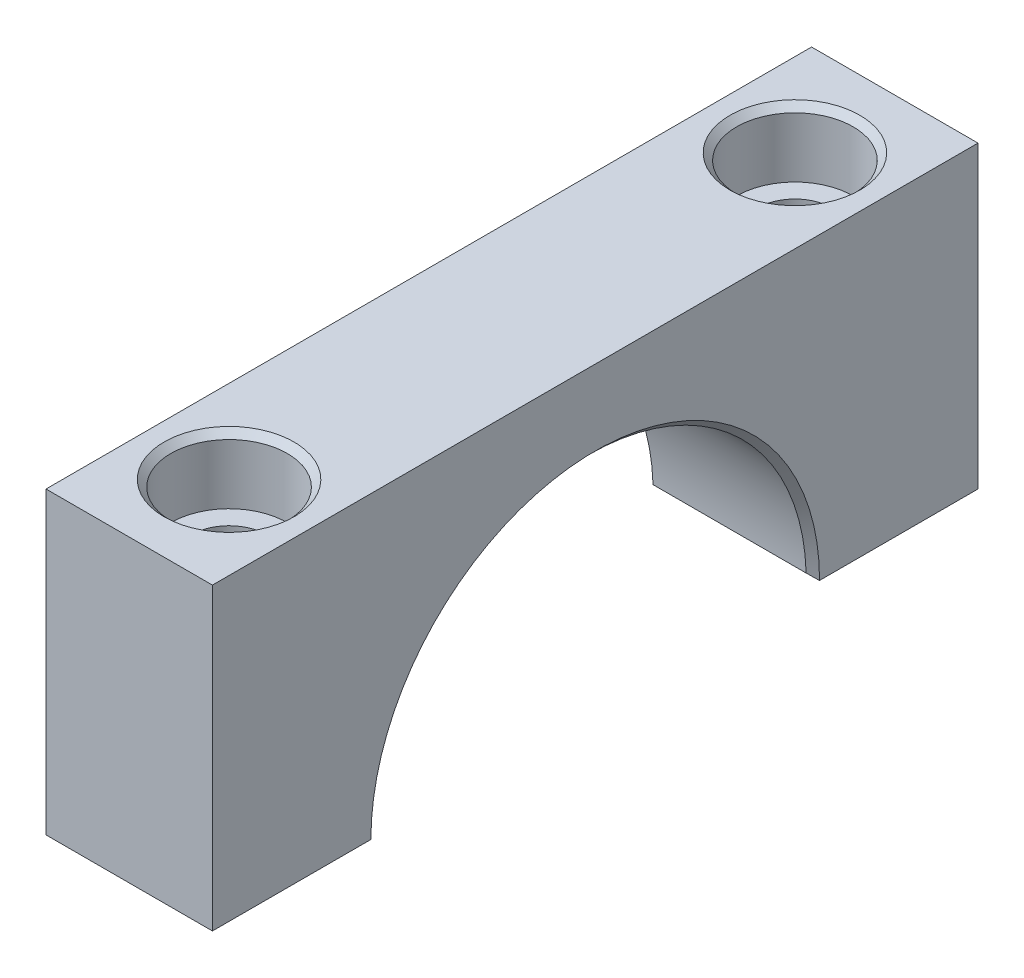
ISO-10303-21;
HEADER;
FILE_DESCRIPTION(('STEP AP214'),'2;1');
FILE_NAME('part.step','',(''),(''),'','','');
FILE_SCHEMA(('AUTOMOTIVE_DESIGN { 1 0 10303 214 1 1 1 1 }'));
ENDSEC;
DATA;
#1=APPLICATION_CONTEXT('core data for automotive mechanical design processes');
#2=APPLICATION_PROTOCOL_DEFINITION('international standard','automotive_design',2000,#1);
#3=PRODUCT_CONTEXT('',#1,'mechanical');
#4=PRODUCT('Part','Part','',(#3));
#5=PRODUCT_RELATED_PRODUCT_CATEGORY('part','',(#4));
#6=PRODUCT_DEFINITION_FORMATION('','',#4);
#7=PRODUCT_DEFINITION_CONTEXT('part definition',#1,'design');
#8=PRODUCT_DEFINITION('design','',#6,#7);
#9=PRODUCT_DEFINITION_SHAPE('','',#8);
#10=(LENGTH_UNIT() NAMED_UNIT(*) SI_UNIT(.MILLI.,.METRE.));
#11=(NAMED_UNIT(*) PLANE_ANGLE_UNIT() SI_UNIT($,.RADIAN.));
#12=(NAMED_UNIT(*) SI_UNIT($,.STERADIAN.) SOLID_ANGLE_UNIT());
#13=UNCERTAINTY_MEASURE_WITH_UNIT(LENGTH_MEASURE(1.E-05),#10,'distance_accuracy_value','');
#14=(GEOMETRIC_REPRESENTATION_CONTEXT(3) GLOBAL_UNCERTAINTY_ASSIGNED_CONTEXT((#13)) GLOBAL_UNIT_ASSIGNED_CONTEXT((#10,
#11,#12)) REPRESENTATION_CONTEXT('',''));
#15=CARTESIAN_POINT('',(0.,0.,0.));
#16=DIRECTION('',(0.,0.,1.));
#17=DIRECTION('',(1.,0.,0.));
#18=AXIS2_PLACEMENT_3D('',#15,#16,#17);
#19=CARTESIAN_POINT('',(15.875,0.,0.));
#20=DIRECTION('',(-1.,0.,0.));
#21=DIRECTION('',(0.,0.,1.));
#22=AXIS2_PLACEMENT_3D('',#19,#20,#21);
#23=CYLINDRICAL_SURFACE('',#22,20.7645);
#24=CARTESIAN_POINT('',(15.24,0.,0.));
#25=DIRECTION('',(1.,0.,0.));
#26=DIRECTION('',(0.,0.,-1.));
#27=AXIS2_PLACEMENT_3D('',#24,#25,#26);
#28=CIRCLE('',#27,20.7645);
#29=CARTESIAN_POINT('',(15.24,0.616157270029674,-20.7553561874662));
#30=VERTEX_POINT('',#29);
#31=CARTESIAN_POINT('',(15.24,0.616157270029674,20.7553561874662));
#32=VERTEX_POINT('',#31);
#33=EDGE_CURVE('E209',#30,#32,#28,.T.);
#34=ORIENTED_EDGE('',*,*,#33,.T.);
#35=DIRECTION('',(-1.,0.,0.));
#36=VECTOR('',#35,1.);
#37=CARTESIAN_POINT('',(15.875,0.616157270029674,20.7553561874662));
#38=LINE('',#37,#36);
#39=CARTESIAN_POINT('',(0.635,0.616157270029674,20.7553561874662));
#40=VERTEX_POINT('',#39);
#41=EDGE_CURVE('E211',#32,#40,#38,.T.);
#42=ORIENTED_EDGE('',*,*,#41,.T.);
#43=CARTESIAN_POINT('',(0.635,0.,0.));
#44=DIRECTION('',(1.,0.,0.));
#45=DIRECTION('',(0.,0.,-1.));
#46=AXIS2_PLACEMENT_3D('',#43,#44,#45);
#47=CIRCLE('',#46,20.7645);
#48=CARTESIAN_POINT('',(0.635,0.616157270029674,-20.7553561874662));
#49=VERTEX_POINT('',#48);
#50=EDGE_CURVE('E150',#40,#49,#47,.F.);
#51=ORIENTED_EDGE('',*,*,#50,.T.);
#52=DIRECTION('',(-1.,0.,0.));
#53=VECTOR('',#52,1.);
#54=CARTESIAN_POINT('',(15.875,0.616157270029674,-20.7553561874662));
#55=LINE('',#54,#53);
#56=EDGE_CURVE('E207',#49,#30,#55,.F.);
#57=ORIENTED_EDGE('',*,*,#56,.T.);
#58=EDGE_LOOP('',(#34,#42,#51,#57));
#59=FACE_BOUND('',#58,.T.);
#60=ADVANCED_FACE('F49',(#59),#23,.F.);
#61=CARTESIAN_POINT('',(15.875,0.,0.));
#62=DIRECTION('',(0.,1.,0.));
#63=DIRECTION('',(0.,0.,1.));
#64=AXIS2_PLACEMENT_3D('',#61,#62,#63);
#65=PLANE('',#64);
#66=CARTESIAN_POINT('',(7.9375,0.,-26.9875));
#67=DIRECTION('',(0.,1.,0.));
#68=DIRECTION('',(0.,0.,1.));
#69=AXIS2_PLACEMENT_3D('',#66,#67,#68);
#70=CIRCLE('',#69,3.57123999999999);
#71=CARTESIAN_POINT('',(7.9375,0.,-23.41626));
#72=VERTEX_POINT('',#71);
#73=EDGE_CURVE('E164',#72,#72,#70,.T.);
#74=ORIENTED_EDGE('',*,*,#73,.T.);
#75=EDGE_LOOP('',(#74));
#76=FACE_BOUND('',#75,.T.);
#77=DIRECTION('',(0.,0.,-1.));
#78=VECTOR('',#77,1.);
#79=CARTESIAN_POINT('',(15.875,0.,0.));
#80=LINE('',#79,#78);
#81=CARTESIAN_POINT('',(15.875,0.,-21.3995));
#82=VERTEX_POINT('',#81);
#83=CARTESIAN_POINT('',(15.875,0.,-36.5125));
#84=VERTEX_POINT('',#83);
#85=EDGE_CURVE('E129',#82,#84,#80,.T.);
#86=ORIENTED_EDGE('',*,*,#85,.F.);
#87=DIRECTION('',(-0.707106781186553,0.,0.707106781186542));
#88=VECTOR('',#87,1.);
#89=CARTESIAN_POINT('',(-5.52450000000034,0.,0.));
#90=LINE('',#89,#88);
#91=CARTESIAN_POINT('',(15.8655765601715,0.,-21.3900765601715));
#92=VERTEX_POINT('',#91);
#93=EDGE_CURVE('E64',#82,#92,#90,.T.);
#94=ORIENTED_EDGE('',*,*,#93,.T.);
#95=DIRECTION('',(-1.,0.,0.));
#96=VECTOR('',#95,1.);
#97=CARTESIAN_POINT('',(0.,0.,-21.3900765601715));
#98=LINE('',#97,#96);
#99=CARTESIAN_POINT('',(0.00942343982845999,0.,-21.3900765601715));
#100=VERTEX_POINT('',#99);
#101=EDGE_CURVE('E75',#92,#100,#98,.T.);
#102=ORIENTED_EDGE('',*,*,#101,.T.);
#103=DIRECTION('',(-0.707106781186553,0.,-0.707106781186542));
#104=VECTOR('',#103,1.);
#105=CARTESIAN_POINT('',(21.3995000000003,0.,0.));
#106=LINE('',#105,#104);
#107=CARTESIAN_POINT('',(0.,0.,-21.3995));
#108=VERTEX_POINT('',#107);
#109=EDGE_CURVE('E222',#100,#108,#106,.T.);
#110=ORIENTED_EDGE('',*,*,#109,.T.);
#111=DIRECTION('',(0.,0.,-1.));
#112=VECTOR('',#111,1.);
#113=CARTESIAN_POINT('',(0.,0.,0.));
#114=LINE('',#113,#112);
#115=CARTESIAN_POINT('',(0.,0.,-36.5125));
#116=VERTEX_POINT('',#115);
#117=EDGE_CURVE('E146',#108,#116,#114,.T.);
#118=ORIENTED_EDGE('',*,*,#117,.T.);
#119=DIRECTION('',(-1.,0.,0.));
#120=VECTOR('',#119,1.);
#121=CARTESIAN_POINT('',(15.875,0.,-36.5125));
#122=LINE('',#121,#120);
#123=EDGE_CURVE('E143',#84,#116,#122,.T.);
#124=ORIENTED_EDGE('',*,*,#123,.F.);
#125=EDGE_LOOP('',(#86,#94,#102,#110,#118,#124));
#126=FACE_BOUND('',#125,.T.);
#127=ADVANCED_FACE('F144',(#76,#126),#65,.F.);
#128=CARTESIAN_POINT('',(15.875,0.,-36.5125));
#129=DIRECTION('',(0.,0.,1.));
#130=DIRECTION('',(1.,0.,0.));
#131=AXIS2_PLACEMENT_3D('',#128,#129,#130);
#132=PLANE('',#131);
#133=DIRECTION('',(0.,1.,0.));
#134=VECTOR('',#133,1.);
#135=CARTESIAN_POINT('',(0.,0.,-36.5125));
#136=LINE('',#135,#134);
#137=CARTESIAN_POINT('',(0.,28.575,-36.5125));
#138=VERTEX_POINT('',#137);
#139=EDGE_CURVE('E163',#116,#138,#136,.T.);
#140=ORIENTED_EDGE('',*,*,#139,.T.);
#141=DIRECTION('',(-1.,0.,0.));
#142=VECTOR('',#141,1.);
#143=CARTESIAN_POINT('',(15.875,28.575,-36.5125));
#144=LINE('',#143,#142);
#145=CARTESIAN_POINT('',(15.875,28.575,-36.5125));
#146=VERTEX_POINT('',#145);
#147=EDGE_CURVE('E151',#146,#138,#144,.T.);
#148=ORIENTED_EDGE('',*,*,#147,.F.);
#149=DIRECTION('',(0.,1.,0.));
#150=VECTOR('',#149,1.);
#151=CARTESIAN_POINT('',(15.875,0.,-36.5125));
#152=LINE('',#151,#150);
#153=EDGE_CURVE('E135',#84,#146,#152,.T.);
#154=ORIENTED_EDGE('',*,*,#153,.F.);
#155=ORIENTED_EDGE('',*,*,#123,.T.);
#156=EDGE_LOOP('',(#140,#148,#154,#155));
#157=FACE_BOUND('',#156,.T.);
#158=ADVANCED_FACE('F153',(#157),#132,.F.);
#159=CARTESIAN_POINT('',(15.875,28.575,0.));
#160=DIRECTION('',(0.,1.,0.));
#161=DIRECTION('',(0.,0.,1.));
#162=AXIS2_PLACEMENT_3D('',#159,#160,#161);
#163=PLANE('',#162);
#164=CARTESIAN_POINT('',(7.93750000000001,28.575,26.9875));
#165=DIRECTION('',(0.,1.,0.));
#166=DIRECTION('',(0.,0.,1.));
#167=AXIS2_PLACEMENT_3D('',#164,#165,#166);
#168=CIRCLE('',#167,6.19125);
#169=CARTESIAN_POINT('',(7.93750000000001,28.575,33.17875));
#170=VERTEX_POINT('',#169);
#171=EDGE_CURVE('E184',#170,#170,#168,.T.);
#172=ORIENTED_EDGE('',*,*,#171,.F.);
#173=EDGE_LOOP('',(#172));
#174=FACE_BOUND('',#173,.T.);
#175=CARTESIAN_POINT('',(7.9375,28.575,-26.9875));
#176=DIRECTION('',(0.,1.,0.));
#177=DIRECTION('',(0.,0.,1.));
#178=AXIS2_PLACEMENT_3D('',#175,#176,#177);
#179=CIRCLE('',#178,6.19125);
#180=CARTESIAN_POINT('',(7.9375,28.575,-20.79625));
#181=VERTEX_POINT('',#180);
#182=EDGE_CURVE('E179',#181,#181,#179,.T.);
#183=ORIENTED_EDGE('',*,*,#182,.F.);
#184=EDGE_LOOP('',(#183));
#185=FACE_BOUND('',#184,.T.);
#186=DIRECTION('',(0.,0.,-1.));
#187=VECTOR('',#186,1.);
#188=CARTESIAN_POINT('',(0.,28.575,0.));
#189=LINE('',#188,#187);
#190=CARTESIAN_POINT('',(0.,28.575,36.5125));
#191=VERTEX_POINT('',#190);
#192=EDGE_CURVE('E166',#191,#138,#189,.T.);
#193=ORIENTED_EDGE('',*,*,#192,.F.);
#194=DIRECTION('',(-1.,0.,0.));
#195=VECTOR('',#194,1.);
#196=CARTESIAN_POINT('',(15.875,28.575,36.5125));
#197=LINE('',#196,#195);
#198=CARTESIAN_POINT('',(15.875,28.575,36.5125));
#199=VERTEX_POINT('',#198);
#200=EDGE_CURVE('E171',#199,#191,#197,.T.);
#201=ORIENTED_EDGE('',*,*,#200,.F.);
#202=DIRECTION('',(0.,0.,-1.));
#203=VECTOR('',#202,1.);
#204=CARTESIAN_POINT('',(15.875,28.575,0.));
#205=LINE('',#204,#203);
#206=EDGE_CURVE('E155',#199,#146,#205,.T.);
#207=ORIENTED_EDGE('',*,*,#206,.T.);
#208=ORIENTED_EDGE('',*,*,#147,.T.);
#209=EDGE_LOOP('',(#193,#201,#207,#208));
#210=FACE_BOUND('',#209,.T.);
#211=ADVANCED_FACE('F290',(#174,#185,#210),#163,.T.);
#212=CARTESIAN_POINT('',(15.875,0.,36.5125));
#213=DIRECTION('',(0.,0.,1.));
#214=DIRECTION('',(1.,0.,0.));
#215=AXIS2_PLACEMENT_3D('',#212,#213,#214);
#216=PLANE('',#215);
#217=DIRECTION('',(0.,1.,0.));
#218=VECTOR('',#217,1.);
#219=CARTESIAN_POINT('',(0.,0.,36.5125));
#220=LINE('',#219,#218);
#221=CARTESIAN_POINT('',(0.,0.,36.5125));
#222=VERTEX_POINT('',#221);
#223=EDGE_CURVE('E167',#222,#191,#220,.T.);
#224=ORIENTED_EDGE('',*,*,#223,.F.);
#225=DIRECTION('',(-1.,0.,0.));
#226=VECTOR('',#225,1.);
#227=CARTESIAN_POINT('',(15.875,0.,36.5125));
#228=LINE('',#227,#226);
#229=CARTESIAN_POINT('',(15.875,0.,36.5125));
#230=VERTEX_POINT('',#229);
#231=EDGE_CURVE('E170',#230,#222,#228,.T.);
#232=ORIENTED_EDGE('',*,*,#231,.F.);
#233=DIRECTION('',(0.,1.,0.));
#234=VECTOR('',#233,1.);
#235=CARTESIAN_POINT('',(15.875,0.,36.5125));
#236=LINE('',#235,#234);
#237=EDGE_CURVE('E157',#230,#199,#236,.T.);
#238=ORIENTED_EDGE('',*,*,#237,.T.);
#239=ORIENTED_EDGE('',*,*,#200,.T.);
#240=EDGE_LOOP('',(#224,#232,#238,#239));
#241=FACE_BOUND('',#240,.T.);
#242=ADVANCED_FACE('F293',(#241),#216,.T.);
#243=CARTESIAN_POINT('',(7.93750000000001,0.,26.9875));
#244=DIRECTION('',(0.,1.,0.));
#245=DIRECTION('',(0.,0.,1.));
#246=AXIS2_PLACEMENT_3D('',#243,#244,#245);
#247=CIRCLE('',#246,3.57123999999999);
#248=CARTESIAN_POINT('',(7.93750000000001,0.,30.55874));
#249=VERTEX_POINT('',#248);
#250=EDGE_CURVE('E176',#249,#249,#247,.T.);
#251=ORIENTED_EDGE('',*,*,#250,.T.);
#252=EDGE_LOOP('',(#251));
#253=FACE_BOUND('',#252,.T.);
#254=DIRECTION('',(1.,0.,0.));
#255=VECTOR('',#254,1.);
#256=CARTESIAN_POINT('',(15.875,0.,21.3900765601715));
#257=LINE('',#256,#255);
#258=CARTESIAN_POINT('',(0.00942343982845983,0.,21.3900765601715));
#259=VERTEX_POINT('',#258);
#260=CARTESIAN_POINT('',(15.8655765601715,0.,21.3900765601715));
#261=VERTEX_POINT('',#260);
#262=EDGE_CURVE('E216',#259,#261,#257,.T.);
#263=ORIENTED_EDGE('',*,*,#262,.T.);
#264=DIRECTION('',(0.707106781186553,0.,0.707106781186542));
#265=VECTOR('',#264,1.);
#266=CARTESIAN_POINT('',(-5.52450000000034,0.,0.));
#267=LINE('',#266,#265);
#268=CARTESIAN_POINT('',(15.875,0.,21.3995));
#269=VERTEX_POINT('',#268);
#270=EDGE_CURVE('E219',#261,#269,#267,.T.);
#271=ORIENTED_EDGE('',*,*,#270,.T.);
#272=EDGE_CURVE('E141',#230,#269,#80,.T.);
#273=ORIENTED_EDGE('',*,*,#272,.F.);
#274=ORIENTED_EDGE('',*,*,#231,.T.);
#275=CARTESIAN_POINT('',(0.,0.,21.3995));
#276=VERTEX_POINT('',#275);
#277=EDGE_CURVE('E139',#222,#276,#114,.T.);
#278=ORIENTED_EDGE('',*,*,#277,.T.);
#279=DIRECTION('',(0.707106781186553,0.,-0.707106781186542));
#280=VECTOR('',#279,1.);
#281=CARTESIAN_POINT('',(21.3995000000003,0.,0.));
#282=LINE('',#281,#280);
#283=EDGE_CURVE('E214',#276,#259,#282,.T.);
#284=ORIENTED_EDGE('',*,*,#283,.T.);
#285=EDGE_LOOP('',(#263,#271,#273,#274,#278,#284));
#286=FACE_BOUND('',#285,.T.);
#287=ADVANCED_FACE('F275',(#253,#286),#65,.F.);
#288=CARTESIAN_POINT('',(15.875,0.,0.));
#289=DIRECTION('',(1.,0.,0.));
#290=DIRECTION('',(0.,0.,-1.));
#291=AXIS2_PLACEMENT_3D('',#288,#289,#290);
#292=PLANE('',#291);
#293=ORIENTED_EDGE('',*,*,#272,.T.);
#294=CARTESIAN_POINT('',(15.875,0.,0.));
#295=DIRECTION('',(1.,0.,0.));
#296=DIRECTION('',(0.,0.,-1.));
#297=AXIS2_PLACEMENT_3D('',#294,#295,#296);
#298=CIRCLE('',#297,21.3995);
#299=EDGE_CURVE('E138',#269,#82,#298,.F.);
#300=ORIENTED_EDGE('',*,*,#299,.T.);
#301=ORIENTED_EDGE('',*,*,#85,.T.);
#302=ORIENTED_EDGE('',*,*,#153,.T.);
#303=ORIENTED_EDGE('',*,*,#206,.F.);
#304=ORIENTED_EDGE('',*,*,#237,.F.);
#305=EDGE_LOOP('',(#293,#300,#301,#302,#303,#304));
#306=FACE_BOUND('',#305,.T.);
#307=ADVANCED_FACE('F132',(#306),#292,.T.);
#308=CARTESIAN_POINT('',(0.,0.,0.));
#309=DIRECTION('',(1.,0.,0.));
#310=DIRECTION('',(0.,0.,-1.));
#311=AXIS2_PLACEMENT_3D('',#308,#309,#310);
#312=PLANE('',#311);
#313=ORIENTED_EDGE('',*,*,#117,.F.);
#314=CARTESIAN_POINT('',(0.,0.,0.));
#315=DIRECTION('',(1.,0.,0.));
#316=DIRECTION('',(0.,0.,-1.));
#317=AXIS2_PLACEMENT_3D('',#314,#315,#316);
#318=CIRCLE('',#317,21.3995);
#319=EDGE_CURVE('E12',#108,#276,#318,.T.);
#320=ORIENTED_EDGE('',*,*,#319,.T.);
#321=ORIENTED_EDGE('',*,*,#277,.F.);
#322=ORIENTED_EDGE('',*,*,#223,.T.);
#323=ORIENTED_EDGE('',*,*,#192,.T.);
#324=ORIENTED_EDGE('',*,*,#139,.F.);
#325=EDGE_LOOP('',(#313,#320,#321,#322,#323,#324));
#326=FACE_BOUND('',#325,.T.);
#327=ADVANCED_FACE('F323',(#326),#312,.F.);
#328=CARTESIAN_POINT('',(7.9375,34.925,-26.9875));
#329=DIRECTION('',(0.,1.,0.));
#330=DIRECTION('',(0.,0.,1.));
#331=AXIS2_PLACEMENT_3D('',#328,#329,#330);
#332=CYLINDRICAL_SURFACE('',#331,3.57123999999999);
#333=CARTESIAN_POINT('',(7.9375,22.225,-26.9875));
#334=DIRECTION('',(0.,1.,0.));
#335=DIRECTION('',(0.,0.,1.));
#336=AXIS2_PLACEMENT_3D('',#333,#334,#335);
#337=CIRCLE('',#336,3.57124);
#338=CARTESIAN_POINT('',(7.9375,22.225,-23.41626));
#339=VERTEX_POINT('',#338);
#340=EDGE_CURVE('E175',#339,#339,#337,.T.);
#341=ORIENTED_EDGE('',*,*,#340,.T.);
#342=EDGE_LOOP('',(#341));
#343=FACE_BOUND('',#342,.T.);
#344=ORIENTED_EDGE('',*,*,#73,.F.);
#345=EDGE_LOOP('',(#344));
#346=FACE_BOUND('',#345,.T.);
#347=ADVANCED_FACE('F288',(#343,#346),#332,.F.);
#348=CARTESIAN_POINT('',(13.49375,22.225,-26.9875));
#349=DIRECTION('',(0.,-1.,0.));
#350=DIRECTION('',(0.,0.,-1.));
#351=AXIS2_PLACEMENT_3D('',#348,#349,#350);
#352=PLANE('',#351);
#353=ORIENTED_EDGE('',*,*,#340,.F.);
#354=EDGE_LOOP('',(#353));
#355=FACE_BOUND('',#354,.T.);
#356=CARTESIAN_POINT('',(7.9375,22.225,-26.9875));
#357=DIRECTION('',(0.,1.,0.));
#358=DIRECTION('',(0.,0.,1.));
#359=AXIS2_PLACEMENT_3D('',#356,#357,#358);
#360=CIRCLE('',#359,5.55625);
#361=CARTESIAN_POINT('',(7.9375,22.225,-21.43125));
#362=VERTEX_POINT('',#361);
#363=EDGE_CURVE('E190',#362,#362,#360,.T.);
#364=ORIENTED_EDGE('',*,*,#363,.T.);
#365=EDGE_LOOP('',(#364));
#366=FACE_BOUND('',#365,.T.);
#367=ADVANCED_FACE('F285',(#355,#366),#352,.F.);
#368=CARTESIAN_POINT('',(7.9375,34.925,-26.9875));
#369=DIRECTION('',(0.,1.,0.));
#370=DIRECTION('',(0.,0.,1.));
#371=AXIS2_PLACEMENT_3D('',#368,#369,#370);
#372=CYLINDRICAL_SURFACE('',#371,5.55625);
#373=ORIENTED_EDGE('',*,*,#363,.F.);
#374=EDGE_LOOP('',(#373));
#375=FACE_BOUND('',#374,.T.);
#376=CARTESIAN_POINT('',(7.9375,27.94,-26.9875));
#377=DIRECTION('',(0.,1.,0.));
#378=DIRECTION('',(0.,0.,1.));
#379=AXIS2_PLACEMENT_3D('',#376,#377,#378);
#380=CIRCLE('',#379,5.55625);
#381=CARTESIAN_POINT('',(7.9375,27.94,-21.43125));
#382=VERTEX_POINT('',#381);
#383=EDGE_CURVE('E183',#382,#382,#380,.T.);
#384=ORIENTED_EDGE('',*,*,#383,.T.);
#385=EDGE_LOOP('',(#384));
#386=FACE_BOUND('',#385,.T.);
#387=ADVANCED_FACE('F283',(#375,#386),#372,.F.);
#388=CARTESIAN_POINT('',(7.9375,28.575,-26.9875));
#389=DIRECTION('',(0.,1.,0.));
#390=DIRECTION('',(0.,0.,1.));
#391=AXIS2_PLACEMENT_3D('',#388,#389,#390);
#392=CONICAL_SURFACE('',#391,6.19125,0.785398163397446);
#393=ORIENTED_EDGE('',*,*,#383,.F.);
#394=EDGE_LOOP('',(#393));
#395=FACE_BOUND('',#394,.T.);
#396=ORIENTED_EDGE('',*,*,#182,.T.);
#397=EDGE_LOOP('',(#396));
#398=FACE_BOUND('',#397,.T.);
#399=ADVANCED_FACE('F279',(#395,#398),#392,.F.);
#400=CARTESIAN_POINT('',(7.93750000000001,34.925,26.9875));
#401=DIRECTION('',(0.,1.,0.));
#402=DIRECTION('',(0.,0.,1.));
#403=AXIS2_PLACEMENT_3D('',#400,#401,#402);
#404=CYLINDRICAL_SURFACE('',#403,3.57123999999999);
#405=CARTESIAN_POINT('',(7.93750000000001,22.225,26.9875));
#406=DIRECTION('',(0.,1.,0.));
#407=DIRECTION('',(0.,0.,1.));
#408=AXIS2_PLACEMENT_3D('',#405,#406,#407);
#409=CIRCLE('',#408,3.57124);
#410=CARTESIAN_POINT('',(7.93750000000001,22.225,30.55874));
#411=VERTEX_POINT('',#410);
#412=EDGE_CURVE('E180',#411,#411,#409,.T.);
#413=ORIENTED_EDGE('',*,*,#412,.T.);
#414=EDGE_LOOP('',(#413));
#415=FACE_BOUND('',#414,.T.);
#416=ORIENTED_EDGE('',*,*,#250,.F.);
#417=EDGE_LOOP('',(#416));
#418=FACE_BOUND('',#417,.T.);
#419=ADVANCED_FACE('F282',(#415,#418),#404,.F.);
#420=CARTESIAN_POINT('',(13.49375,22.225,26.9875));
#421=DIRECTION('',(0.,-1.,0.));
#422=DIRECTION('',(0.,0.,-1.));
#423=AXIS2_PLACEMENT_3D('',#420,#421,#422);
#424=PLANE('',#423);
#425=ORIENTED_EDGE('',*,*,#412,.F.);
#426=EDGE_LOOP('',(#425));
#427=FACE_BOUND('',#426,.T.);
#428=CARTESIAN_POINT('',(7.93750000000001,22.225,26.9875));
#429=DIRECTION('',(0.,1.,0.));
#430=DIRECTION('',(0.,0.,1.));
#431=AXIS2_PLACEMENT_3D('',#428,#429,#430);
#432=CIRCLE('',#431,5.55625);
#433=CARTESIAN_POINT('',(7.93750000000001,22.225,32.54375));
#434=VERTEX_POINT('',#433);
#435=EDGE_CURVE('E197',#434,#434,#432,.T.);
#436=ORIENTED_EDGE('',*,*,#435,.T.);
#437=EDGE_LOOP('',(#436));
#438=FACE_BOUND('',#437,.T.);
#439=ADVANCED_FACE('F298',(#427,#438),#424,.F.);
#440=CARTESIAN_POINT('',(7.93750000000001,34.925,26.9875));
#441=DIRECTION('',(0.,1.,0.));
#442=DIRECTION('',(0.,0.,1.));
#443=AXIS2_PLACEMENT_3D('',#440,#441,#442);
#444=CYLINDRICAL_SURFACE('',#443,5.55625);
#445=ORIENTED_EDGE('',*,*,#435,.F.);
#446=EDGE_LOOP('',(#445));
#447=FACE_BOUND('',#446,.T.);
#448=CARTESIAN_POINT('',(7.93750000000001,27.94,26.9875));
#449=DIRECTION('',(0.,1.,0.));
#450=DIRECTION('',(0.,0.,1.));
#451=AXIS2_PLACEMENT_3D('',#448,#449,#450);
#452=CIRCLE('',#451,5.55625);
#453=CARTESIAN_POINT('',(7.93750000000001,27.94,32.54375));
#454=VERTEX_POINT('',#453);
#455=EDGE_CURVE('E187',#454,#454,#452,.T.);
#456=ORIENTED_EDGE('',*,*,#455,.T.);
#457=EDGE_LOOP('',(#456));
#458=FACE_BOUND('',#457,.T.);
#459=ADVANCED_FACE('F296',(#447,#458),#444,.F.);
#460=CARTESIAN_POINT('',(7.93750000000001,28.575,26.9875));
#461=DIRECTION('',(0.,1.,0.));
#462=DIRECTION('',(0.,0.,1.));
#463=AXIS2_PLACEMENT_3D('',#460,#461,#462);
#464=CONICAL_SURFACE('',#463,6.19125,0.785398163397446);
#465=ORIENTED_EDGE('',*,*,#455,.F.);
#466=EDGE_LOOP('',(#465));
#467=FACE_BOUND('',#466,.T.);
#468=ORIENTED_EDGE('',*,*,#171,.T.);
#469=EDGE_LOOP('',(#468));
#470=FACE_BOUND('',#469,.T.);
#471=ADVANCED_FACE('F264',(#467,#470),#464,.F.);
#472=CARTESIAN_POINT('',(15.875,0.,-21.3900765601715));
#473=DIRECTION('',(0.,0.717521285574314,-0.696536578183647));
#474=DIRECTION('',(-1.,0.,0.));
#475=AXIS2_PLACEMENT_3D('',#472,#473,#474);
#476=PLANE('',#475);
#477=CARTESIAN_POINT('',(0.00942343982845999,0.,-21.3900765601715));
#478=CARTESIAN_POINT('',(0.11471717403378,0.102185013158632,-21.2848129971305));
#479=CARTESIAN_POINT('',(0.219495411785423,0.204623949544591,-21.1792878608624));
#480=CARTESIAN_POINT('',(0.428020932216734,0.41000970603686,-20.9677144034838));
#481=CARTESIAN_POINT('',(0.531768214522271,0.512956526327458,-20.8616660821834));
#482=CARTESIAN_POINT('',(0.634999999999999,0.616157270029674,-20.7553561874662));
#483=B_SPLINE_CURVE_WITH_KNOTS('',3,(#477,#478,#479,#480,#481,#482),.UNSPECIFIED.,.F.,.F.,(4,2,
4),(0.,0.54172864296396,1.0834574825131),.UNSPECIFIED.);
#484=EDGE_CURVE('E335',#100,#49,#483,.T.);
#485=ORIENTED_EDGE('',*,*,#484,.F.);
#486=ORIENTED_EDGE('',*,*,#101,.F.);
#487=CARTESIAN_POINT('',(15.8655765601715,0.,-21.3900765601715));
#488=CARTESIAN_POINT('',(15.7602828259662,0.102185013158632,-21.2848129971305));
#489=CARTESIAN_POINT('',(15.6555045882146,0.204623949544591,-21.1792878608624));
#490=CARTESIAN_POINT('',(15.4469790677833,0.410009706036859,-20.9677144034838));
#491=CARTESIAN_POINT('',(15.3432317854777,0.512956526327458,-20.8616660821834));
#492=CARTESIAN_POINT('',(15.24,0.616157270029675,-20.7553561874662));
#493=B_SPLINE_CURVE_WITH_KNOTS('',3,(#487,#488,#489,#490,#491,#492),.UNSPECIFIED.,.F.,.F.,(4,2,
4),(0.,0.541728642963961,1.0834574825131),.UNSPECIFIED.);
#494=EDGE_CURVE('E55',#30,#92,#493,.F.);
#495=ORIENTED_EDGE('',*,*,#494,.F.);
#496=ORIENTED_EDGE('',*,*,#56,.F.);
#497=EDGE_LOOP('',(#485,#486,#495,#496));
#498=FACE_BOUND('',#497,.T.);
#499=ADVANCED_FACE('F52',(#498),#476,.F.);
#500=CARTESIAN_POINT('',(15.24,0.,0.));
#501=DIRECTION('',(1.,0.,0.));
#502=DIRECTION('',(0.,0.,-1.));
#503=AXIS2_PLACEMENT_3D('',#500,#501,#502);
#504=CONICAL_SURFACE('',#503,20.7645,0.78539816339744);
#505=ORIENTED_EDGE('',*,*,#299,.F.);
#506=ORIENTED_EDGE('',*,*,#270,.F.);
#507=CARTESIAN_POINT('',(15.8655765601715,0.,21.3900765601715));
#508=CARTESIAN_POINT('',(15.7602828259662,0.102185013158632,21.2848129971305));
#509=CARTESIAN_POINT('',(15.6555045882146,0.204623949544591,21.1792878608624));
#510=CARTESIAN_POINT('',(15.4469790677833,0.410009706036859,20.9677144034838));
#511=CARTESIAN_POINT('',(15.3432317854777,0.512956526327458,20.8616660821834));
#512=CARTESIAN_POINT('',(15.24,0.616157270029675,20.7553561874662));
#513=B_SPLINE_CURVE_WITH_KNOTS('',3,(#507,#508,#509,#510,#511,#512),.UNSPECIFIED.,.F.,.F.,(4,2,
4),(0.,0.541728642963961,1.0834574825131),.UNSPECIFIED.);
#514=EDGE_CURVE('E234',#32,#261,#513,.F.);
#515=ORIENTED_EDGE('',*,*,#514,.F.);
#516=ORIENTED_EDGE('',*,*,#33,.F.);
#517=ORIENTED_EDGE('',*,*,#494,.T.);
#518=ORIENTED_EDGE('',*,*,#93,.F.);
#519=EDGE_LOOP('',(#505,#506,#515,#516,#517,#518));
#520=FACE_BOUND('',#519,.T.);
#521=ADVANCED_FACE('F251',(#520),#504,.F.);
#522=CARTESIAN_POINT('',(0.,0.,0.));
#523=DIRECTION('',(-1.,0.,0.));
#524=DIRECTION('',(0.,0.,1.));
#525=AXIS2_PLACEMENT_3D('',#522,#523,#524);
#526=CONICAL_SURFACE('',#525,21.3995,0.78539816339744);
#527=ORIENTED_EDGE('',*,*,#484,.T.);
#528=ORIENTED_EDGE('',*,*,#50,.F.);
#529=CARTESIAN_POINT('',(0.635,0.616157270029674,20.7553561874662));
#530=CARTESIAN_POINT('',(0.531768214522272,0.512956526327458,20.8616660821834));
#531=CARTESIAN_POINT('',(0.428020932216735,0.41000970603686,20.9677144034838));
#532=CARTESIAN_POINT('',(0.219495411785423,0.204623949544592,21.1792878608624));
#533=CARTESIAN_POINT('',(0.11471717403378,0.102185013158632,21.2848129971305));
#534=CARTESIAN_POINT('',(0.00942343982846062,0.,21.3900765601715));
#535=B_SPLINE_CURVE_WITH_KNOTS('',3,(#529,#530,#531,#532,#533,#534),.UNSPECIFIED.,.F.,.F.,(4,2,
4),(0.,0.541728839549139,1.0834574825131),.UNSPECIFIED.);
#536=EDGE_CURVE('E226',#259,#40,#535,.F.);
#537=ORIENTED_EDGE('',*,*,#536,.F.);
#538=ORIENTED_EDGE('',*,*,#283,.F.);
#539=ORIENTED_EDGE('',*,*,#319,.F.);
#540=ORIENTED_EDGE('',*,*,#109,.F.);
#541=EDGE_LOOP('',(#527,#528,#537,#538,#539,#540));
#542=FACE_BOUND('',#541,.T.);
#543=ADVANCED_FACE('F240',(#542),#526,.F.);
#544=CARTESIAN_POINT('',(15.875,0.616157270029674,20.7553561874662));
#545=DIRECTION('',(0.,0.717521285574314,0.696536578183647));
#546=DIRECTION('',(-1.,0.,0.));
#547=AXIS2_PLACEMENT_3D('',#544,#545,#546);
#548=PLANE('',#547);
#549=ORIENTED_EDGE('',*,*,#514,.T.);
#550=ORIENTED_EDGE('',*,*,#262,.F.);
#551=ORIENTED_EDGE('',*,*,#536,.T.);
#552=ORIENTED_EDGE('',*,*,#41,.F.);
#553=EDGE_LOOP('',(#549,#550,#551,#552));
#554=FACE_BOUND('',#553,.T.);
#555=ADVANCED_FACE('F244',(#554),#548,.F.);
#556=CLOSED_SHELL('',(#60,#127,#158,#211,#242,#287,#307,#327,#347,#367,#387,#399,#419,#439,#459,
#471,#499,#521,#543,#555));
#557=MANIFOLD_SOLID_BREP('B2',#556);
#558=ADVANCED_BREP_SHAPE_REPRESENTATION('',(#18,#557),#14);
#559=SHAPE_DEFINITION_REPRESENTATION(#9,#558);
ENDSEC;
END-ISO-10303-21;
